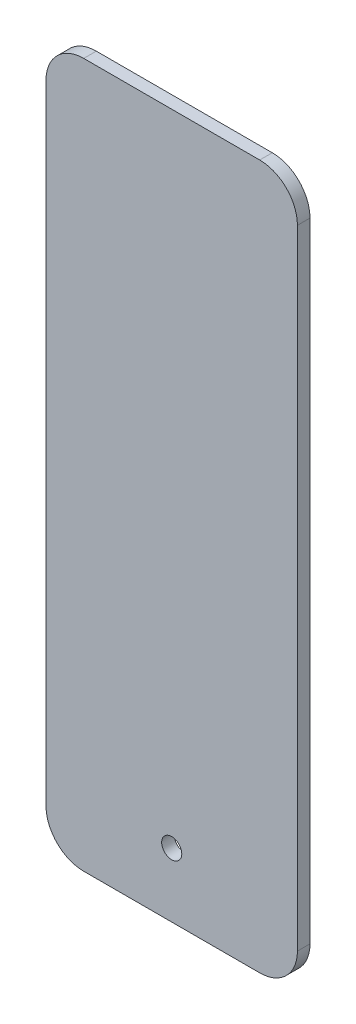
ISO-10303-21;
HEADER;
FILE_DESCRIPTION(('STEP AP214'),'2;1');
FILE_NAME('part.step','',(''),(''),'','','');
FILE_SCHEMA(('AUTOMOTIVE_DESIGN { 1 0 10303 214 1 1 1 1 }'));
ENDSEC;
DATA;
#1=APPLICATION_CONTEXT('core data for automotive mechanical design processes');
#2=APPLICATION_PROTOCOL_DEFINITION('international standard','automotive_design',2000,#1);
#3=PRODUCT_CONTEXT('',#1,'mechanical');
#4=PRODUCT('Part','Part','',(#3));
#5=PRODUCT_RELATED_PRODUCT_CATEGORY('part','',(#4));
#6=PRODUCT_DEFINITION_FORMATION('','',#4);
#7=PRODUCT_DEFINITION_CONTEXT('part definition',#1,'design');
#8=PRODUCT_DEFINITION('design','',#6,#7);
#9=PRODUCT_DEFINITION_SHAPE('','',#8);
#10=(LENGTH_UNIT() NAMED_UNIT(*) SI_UNIT(.MILLI.,.METRE.));
#11=(NAMED_UNIT(*) PLANE_ANGLE_UNIT() SI_UNIT($,.RADIAN.));
#12=(NAMED_UNIT(*) SI_UNIT($,.STERADIAN.) SOLID_ANGLE_UNIT());
#13=UNCERTAINTY_MEASURE_WITH_UNIT(LENGTH_MEASURE(1.E-05),#10,'distance_accuracy_value','');
#14=(GEOMETRIC_REPRESENTATION_CONTEXT(3) GLOBAL_UNCERTAINTY_ASSIGNED_CONTEXT((#13)) GLOBAL_UNIT_ASSIGNED_CONTEXT((#10,
#11,#12)) REPRESENTATION_CONTEXT('',''));
#15=CARTESIAN_POINT('',(0.,0.,0.));
#16=DIRECTION('',(0.,0.,1.));
#17=DIRECTION('',(1.,0.,0.));
#18=AXIS2_PLACEMENT_3D('',#15,#16,#17);
#19=CARTESIAN_POINT('',(35.,125.,-5.));
#20=DIRECTION('',(0.,0.,1.));
#21=DIRECTION('',(1.,0.,0.));
#22=AXIS2_PLACEMENT_3D('',#19,#20,#21);
#23=CYLINDRICAL_SURFACE('',#22,15.);
#24=CARTESIAN_POINT('',(35.,125.,0.));
#25=DIRECTION('',(0.,0.,1.));
#26=DIRECTION('',(-1.,0.,0.));
#27=AXIS2_PLACEMENT_3D('',#24,#25,#26);
#28=CIRCLE('',#27,15.);
#29=CARTESIAN_POINT('',(50.,125.,0.));
#30=VERTEX_POINT('',#29);
#31=CARTESIAN_POINT('',(34.9999999999999,140.,0.));
#32=VERTEX_POINT('',#31);
#33=EDGE_CURVE('E138',#30,#32,#28,.T.);
#34=ORIENTED_EDGE('',*,*,#33,.F.);
#35=DIRECTION('',(0.,0.,1.));
#36=VECTOR('',#35,1.);
#37=CARTESIAN_POINT('',(50.,125.,-5.));
#38=LINE('',#37,#36);
#39=CARTESIAN_POINT('',(50.,125.,-5.));
#40=VERTEX_POINT('',#39);
#41=EDGE_CURVE('E11',#40,#30,#38,.T.);
#42=ORIENTED_EDGE('',*,*,#41,.F.);
#43=CARTESIAN_POINT('',(35.,125.,-5.));
#44=DIRECTION('',(0.,0.,1.));
#45=DIRECTION('',(-1.,0.,0.));
#46=AXIS2_PLACEMENT_3D('',#43,#44,#45);
#47=CIRCLE('',#46,15.);
#48=CARTESIAN_POINT('',(34.9999999999999,140.,-5.));
#49=VERTEX_POINT('',#48);
#50=EDGE_CURVE('E159',#40,#49,#47,.T.);
#51=ORIENTED_EDGE('',*,*,#50,.T.);
#52=DIRECTION('',(0.,0.,1.));
#53=VECTOR('',#52,1.);
#54=CARTESIAN_POINT('',(34.9999999999999,140.,-5.));
#55=LINE('',#54,#53);
#56=EDGE_CURVE('E44',#49,#32,#55,.T.);
#57=ORIENTED_EDGE('',*,*,#56,.T.);
#58=EDGE_LOOP('',(#34,#42,#51,#57));
#59=FACE_BOUND('',#58,.T.);
#60=ADVANCED_FACE('F41',(#59),#23,.T.);
#61=CARTESIAN_POINT('',(50.,125.,-5.));
#62=DIRECTION('',(1.,0.,0.));
#63=DIRECTION('',(0.,1.,0.));
#64=AXIS2_PLACEMENT_3D('',#61,#62,#63);
#65=PLANE('',#64);
#66=DIRECTION('',(0.,1.,0.));
#67=VECTOR('',#66,1.);
#68=CARTESIAN_POINT('',(50.,125.,0.));
#69=LINE('',#68,#67);
#70=CARTESIAN_POINT('',(50.,-125.,0.));
#71=VERTEX_POINT('',#70);
#72=EDGE_CURVE('E157',#71,#30,#69,.T.);
#73=ORIENTED_EDGE('',*,*,#72,.F.);
#74=DIRECTION('',(0.,0.,1.));
#75=VECTOR('',#74,1.);
#76=CARTESIAN_POINT('',(50.,-125.,-5.));
#77=LINE('',#76,#75);
#78=CARTESIAN_POINT('',(50.,-125.,-5.));
#79=VERTEX_POINT('',#78);
#80=EDGE_CURVE('E50',#79,#71,#77,.T.);
#81=ORIENTED_EDGE('',*,*,#80,.F.);
#82=DIRECTION('',(0.,1.,0.));
#83=VECTOR('',#82,1.);
#84=CARTESIAN_POINT('',(50.,125.,-5.));
#85=LINE('',#84,#83);
#86=EDGE_CURVE('E128',#79,#40,#85,.T.);
#87=ORIENTED_EDGE('',*,*,#86,.T.);
#88=ORIENTED_EDGE('',*,*,#41,.T.);
#89=EDGE_LOOP('',(#73,#81,#87,#88));
#90=FACE_BOUND('',#89,.T.);
#91=ADVANCED_FACE('F171',(#90),#65,.T.);
#92=CARTESIAN_POINT('',(35.,-125.,-5.));
#93=DIRECTION('',(0.,0.,1.));
#94=DIRECTION('',(1.,0.,0.));
#95=AXIS2_PLACEMENT_3D('',#92,#93,#94);
#96=CYLINDRICAL_SURFACE('',#95,15.);
#97=CARTESIAN_POINT('',(35.,-125.,0.));
#98=DIRECTION('',(0.,0.,1.));
#99=DIRECTION('',(1.,0.,0.));
#100=AXIS2_PLACEMENT_3D('',#97,#98,#99);
#101=CIRCLE('',#100,15.);
#102=CARTESIAN_POINT('',(34.9999999999999,-140.,0.));
#103=VERTEX_POINT('',#102);
#104=EDGE_CURVE('E115',#103,#71,#101,.T.);
#105=ORIENTED_EDGE('',*,*,#104,.F.);
#106=DIRECTION('',(0.,0.,1.));
#107=VECTOR('',#106,1.);
#108=CARTESIAN_POINT('',(34.9999999999999,-140.,-5.));
#109=LINE('',#108,#107);
#110=CARTESIAN_POINT('',(34.9999999999999,-140.,-5.));
#111=VERTEX_POINT('',#110);
#112=EDGE_CURVE('E110',#111,#103,#109,.T.);
#113=ORIENTED_EDGE('',*,*,#112,.F.);
#114=CARTESIAN_POINT('',(35.,-125.,-5.));
#115=DIRECTION('',(0.,0.,1.));
#116=DIRECTION('',(1.,0.,0.));
#117=AXIS2_PLACEMENT_3D('',#114,#115,#116);
#118=CIRCLE('',#117,15.);
#119=EDGE_CURVE('E113',#111,#79,#118,.T.);
#120=ORIENTED_EDGE('',*,*,#119,.T.);
#121=ORIENTED_EDGE('',*,*,#80,.T.);
#122=EDGE_LOOP('',(#105,#113,#120,#121));
#123=FACE_BOUND('',#122,.T.);
#124=ADVANCED_FACE('F112',(#123),#96,.T.);
#125=CARTESIAN_POINT('',(-34.9999999999999,-140.,-5.));
#126=DIRECTION('',(0.,-1.,0.));
#127=DIRECTION('',(0.,0.,-1.));
#128=AXIS2_PLACEMENT_3D('',#125,#126,#127);
#129=PLANE('',#128);
#130=DIRECTION('',(1.,0.,0.));
#131=VECTOR('',#130,1.);
#132=CARTESIAN_POINT('',(-34.9999999999999,-140.,0.));
#133=LINE('',#132,#131);
#134=CARTESIAN_POINT('',(-34.9999999999999,-140.,0.));
#135=VERTEX_POINT('',#134);
#136=EDGE_CURVE('E154',#135,#103,#133,.T.);
#137=ORIENTED_EDGE('',*,*,#136,.F.);
#138=DIRECTION('',(0.,0.,1.));
#139=VECTOR('',#138,1.);
#140=CARTESIAN_POINT('',(-34.9999999999999,-140.,-5.));
#141=LINE('',#140,#139);
#142=CARTESIAN_POINT('',(-34.9999999999999,-140.,-5.));
#143=VERTEX_POINT('',#142);
#144=EDGE_CURVE('E120',#143,#135,#141,.T.);
#145=ORIENTED_EDGE('',*,*,#144,.F.);
#146=DIRECTION('',(1.,0.,0.));
#147=VECTOR('',#146,1.);
#148=CARTESIAN_POINT('',(-34.9999999999999,-140.,-5.));
#149=LINE('',#148,#147);
#150=EDGE_CURVE('E126',#143,#111,#149,.T.);
#151=ORIENTED_EDGE('',*,*,#150,.T.);
#152=ORIENTED_EDGE('',*,*,#112,.T.);
#153=EDGE_LOOP('',(#137,#145,#151,#152));
#154=FACE_BOUND('',#153,.T.);
#155=ADVANCED_FACE('F130',(#154),#129,.T.);
#156=CARTESIAN_POINT('',(-35.,-125.,-5.));
#157=DIRECTION('',(0.,0.,1.));
#158=DIRECTION('',(1.,0.,0.));
#159=AXIS2_PLACEMENT_3D('',#156,#157,#158);
#160=CYLINDRICAL_SURFACE('',#159,15.);
#161=CARTESIAN_POINT('',(-35.,-125.,0.));
#162=DIRECTION('',(0.,0.,1.));
#163=DIRECTION('',(1.,0.,0.));
#164=AXIS2_PLACEMENT_3D('',#161,#162,#163);
#165=CIRCLE('',#164,15.);
#166=CARTESIAN_POINT('',(-50.,-125.,0.));
#167=VERTEX_POINT('',#166);
#168=EDGE_CURVE('E151',#167,#135,#165,.T.);
#169=ORIENTED_EDGE('',*,*,#168,.F.);
#170=DIRECTION('',(0.,0.,1.));
#171=VECTOR('',#170,1.);
#172=CARTESIAN_POINT('',(-50.,-125.,-5.));
#173=LINE('',#172,#171);
#174=CARTESIAN_POINT('',(-50.,-125.,-5.));
#175=VERTEX_POINT('',#174);
#176=EDGE_CURVE('E163',#175,#167,#173,.T.);
#177=ORIENTED_EDGE('',*,*,#176,.F.);
#178=CARTESIAN_POINT('',(-35.,-125.,-5.));
#179=DIRECTION('',(0.,0.,1.));
#180=DIRECTION('',(1.,0.,0.));
#181=AXIS2_PLACEMENT_3D('',#178,#179,#180);
#182=CIRCLE('',#181,15.);
#183=EDGE_CURVE('E131',#175,#143,#182,.T.);
#184=ORIENTED_EDGE('',*,*,#183,.T.);
#185=ORIENTED_EDGE('',*,*,#144,.T.);
#186=EDGE_LOOP('',(#169,#177,#184,#185));
#187=FACE_BOUND('',#186,.T.);
#188=ADVANCED_FACE('F184',(#187),#160,.T.);
#189=CARTESIAN_POINT('',(-50.,125.,-5.));
#190=DIRECTION('',(-1.,0.,0.));
#191=DIRECTION('',(0.,-1.,0.));
#192=AXIS2_PLACEMENT_3D('',#189,#190,#191);
#193=PLANE('',#192);
#194=DIRECTION('',(0.,-1.,0.));
#195=VECTOR('',#194,1.);
#196=CARTESIAN_POINT('',(-50.,125.,0.));
#197=LINE('',#196,#195);
#198=CARTESIAN_POINT('',(-50.,125.,0.));
#199=VERTEX_POINT('',#198);
#200=EDGE_CURVE('E148',#199,#167,#197,.T.);
#201=ORIENTED_EDGE('',*,*,#200,.F.);
#202=DIRECTION('',(0.,0.,1.));
#203=VECTOR('',#202,1.);
#204=CARTESIAN_POINT('',(-50.,125.,-5.));
#205=LINE('',#204,#203);
#206=CARTESIAN_POINT('',(-50.,125.,-5.));
#207=VERTEX_POINT('',#206);
#208=EDGE_CURVE('E165',#207,#199,#205,.T.);
#209=ORIENTED_EDGE('',*,*,#208,.F.);
#210=DIRECTION('',(0.,-1.,0.));
#211=VECTOR('',#210,1.);
#212=CARTESIAN_POINT('',(-50.,125.,-5.));
#213=LINE('',#212,#211);
#214=EDGE_CURVE('E133',#207,#175,#213,.T.);
#215=ORIENTED_EDGE('',*,*,#214,.T.);
#216=ORIENTED_EDGE('',*,*,#176,.T.);
#217=EDGE_LOOP('',(#201,#209,#215,#216));
#218=FACE_BOUND('',#217,.T.);
#219=ADVANCED_FACE('F187',(#218),#193,.T.);
#220=CARTESIAN_POINT('',(-35.,125.,-5.));
#221=DIRECTION('',(0.,0.,1.));
#222=DIRECTION('',(1.,0.,0.));
#223=AXIS2_PLACEMENT_3D('',#220,#221,#222);
#224=CYLINDRICAL_SURFACE('',#223,15.);
#225=CARTESIAN_POINT('',(-35.,125.,0.));
#226=DIRECTION('',(0.,0.,1.));
#227=DIRECTION('',(1.,0.,0.));
#228=AXIS2_PLACEMENT_3D('',#225,#226,#227);
#229=CIRCLE('',#228,15.);
#230=CARTESIAN_POINT('',(-34.9999999999999,140.,0.));
#231=VERTEX_POINT('',#230);
#232=EDGE_CURVE('E145',#231,#199,#229,.T.);
#233=ORIENTED_EDGE('',*,*,#232,.F.);
#234=DIRECTION('',(0.,0.,1.));
#235=VECTOR('',#234,1.);
#236=CARTESIAN_POINT('',(-34.9999999999999,140.,-5.));
#237=LINE('',#236,#235);
#238=CARTESIAN_POINT('',(-34.9999999999999,140.,-5.));
#239=VERTEX_POINT('',#238);
#240=EDGE_CURVE('E166',#239,#231,#237,.T.);
#241=ORIENTED_EDGE('',*,*,#240,.F.);
#242=CARTESIAN_POINT('',(-35.,125.,-5.));
#243=DIRECTION('',(0.,0.,1.));
#244=DIRECTION('',(1.,0.,0.));
#245=AXIS2_PLACEMENT_3D('',#242,#243,#244);
#246=CIRCLE('',#245,15.);
#247=EDGE_CURVE('E222',#239,#207,#246,.T.);
#248=ORIENTED_EDGE('',*,*,#247,.T.);
#249=ORIENTED_EDGE('',*,*,#208,.T.);
#250=EDGE_LOOP('',(#233,#241,#248,#249));
#251=FACE_BOUND('',#250,.T.);
#252=ADVANCED_FACE('F191',(#251),#224,.T.);
#253=CARTESIAN_POINT('',(-34.9999999999999,140.,-5.));
#254=DIRECTION('',(0.,1.,0.));
#255=DIRECTION('',(0.,0.,1.));
#256=AXIS2_PLACEMENT_3D('',#253,#254,#255);
#257=PLANE('',#256);
#258=DIRECTION('',(-1.,0.,0.));
#259=VECTOR('',#258,1.);
#260=CARTESIAN_POINT('',(-34.9999999999999,140.,0.));
#261=LINE('',#260,#259);
#262=EDGE_CURVE('E141',#32,#231,#261,.T.);
#263=ORIENTED_EDGE('',*,*,#262,.F.);
#264=ORIENTED_EDGE('',*,*,#56,.F.);
#265=DIRECTION('',(-1.,0.,0.));
#266=VECTOR('',#265,1.);
#267=CARTESIAN_POINT('',(-34.9999999999999,140.,-5.));
#268=LINE('',#267,#266);
#269=EDGE_CURVE('E220',#49,#239,#268,.T.);
#270=ORIENTED_EDGE('',*,*,#269,.T.);
#271=ORIENTED_EDGE('',*,*,#240,.T.);
#272=EDGE_LOOP('',(#263,#264,#270,#271));
#273=FACE_BOUND('',#272,.T.);
#274=ADVANCED_FACE('F168',(#273),#257,.T.);
#275=CARTESIAN_POINT('',(35.,125.,-5.));
#276=DIRECTION('',(0.,0.,-1.));
#277=DIRECTION('',(-1.,0.,0.));
#278=AXIS2_PLACEMENT_3D('',#275,#276,#277);
#279=PLANE('',#278);
#280=CARTESIAN_POINT('',(0.,-114.537631934994,-5.));
#281=DIRECTION('',(0.,0.,1.));
#282=DIRECTION('',(1.,0.,0.));
#283=AXIS2_PLACEMENT_3D('',#280,#281,#282);
#284=CIRCLE('',#283,4.);
#285=CARTESIAN_POINT('',(4.,-114.537631934994,-5.));
#286=VERTEX_POINT('',#285);
#287=EDGE_CURVE('E142',#286,#286,#284,.T.);
#288=ORIENTED_EDGE('',*,*,#287,.T.);
#289=EDGE_LOOP('',(#288));
#290=FACE_BOUND('',#289,.T.);
#291=ORIENTED_EDGE('',*,*,#50,.F.);
#292=ORIENTED_EDGE('',*,*,#86,.F.);
#293=ORIENTED_EDGE('',*,*,#119,.F.);
#294=ORIENTED_EDGE('',*,*,#150,.F.);
#295=ORIENTED_EDGE('',*,*,#183,.F.);
#296=ORIENTED_EDGE('',*,*,#214,.F.);
#297=ORIENTED_EDGE('',*,*,#247,.F.);
#298=ORIENTED_EDGE('',*,*,#269,.F.);
#299=EDGE_LOOP('',(#291,#292,#293,#294,#295,#296,#297,#298));
#300=FACE_BOUND('',#299,.T.);
#301=ADVANCED_FACE('F124',(#290,#300),#279,.T.);
#302=CARTESIAN_POINT('',(35.,125.,0.));
#303=DIRECTION('',(0.,0.,-1.));
#304=DIRECTION('',(-1.,0.,0.));
#305=AXIS2_PLACEMENT_3D('',#302,#303,#304);
#306=PLANE('',#305);
#307=CARTESIAN_POINT('',(0.,-114.537631934994,0.));
#308=DIRECTION('',(0.,0.,1.));
#309=DIRECTION('',(1.,0.,0.));
#310=AXIS2_PLACEMENT_3D('',#307,#308,#309);
#311=CIRCLE('',#310,4.);
#312=CARTESIAN_POINT('',(4.,-114.537631934994,0.));
#313=VERTEX_POINT('',#312);
#314=EDGE_CURVE('E215',#313,#313,#311,.T.);
#315=ORIENTED_EDGE('',*,*,#314,.F.);
#316=EDGE_LOOP('',(#315));
#317=FACE_BOUND('',#316,.T.);
#318=ORIENTED_EDGE('',*,*,#33,.T.);
#319=ORIENTED_EDGE('',*,*,#262,.T.);
#320=ORIENTED_EDGE('',*,*,#232,.T.);
#321=ORIENTED_EDGE('',*,*,#200,.T.);
#322=ORIENTED_EDGE('',*,*,#168,.T.);
#323=ORIENTED_EDGE('',*,*,#136,.T.);
#324=ORIENTED_EDGE('',*,*,#104,.T.);
#325=ORIENTED_EDGE('',*,*,#72,.T.);
#326=EDGE_LOOP('',(#318,#319,#320,#321,#322,#323,#324,#325));
#327=FACE_BOUND('',#326,.T.);
#328=ADVANCED_FACE('F170',(#317,#327),#306,.F.);
#329=CARTESIAN_POINT('',(0.,-114.537631934994,-5.));
#330=DIRECTION('',(0.,0.,1.));
#331=DIRECTION('',(1.,0.,0.));
#332=AXIS2_PLACEMENT_3D('',#329,#330,#331);
#333=CYLINDRICAL_SURFACE('',#332,4.);
#334=ORIENTED_EDGE('',*,*,#287,.F.);
#335=EDGE_LOOP('',(#334));
#336=FACE_BOUND('',#335,.T.);
#337=ORIENTED_EDGE('',*,*,#314,.T.);
#338=EDGE_LOOP('',(#337));
#339=FACE_BOUND('',#338,.T.);
#340=ADVANCED_FACE('F203',(#336,#339),#333,.F.);
#341=CLOSED_SHELL('',(#60,#91,#124,#155,#188,#219,#252,#274,#301,#328,#340));
#342=MANIFOLD_SOLID_BREP('B2',#341);
#343=ADVANCED_BREP_SHAPE_REPRESENTATION('',(#18,#342),#14);
#344=SHAPE_DEFINITION_REPRESENTATION(#9,#343);
ENDSEC;
END-ISO-10303-21;
